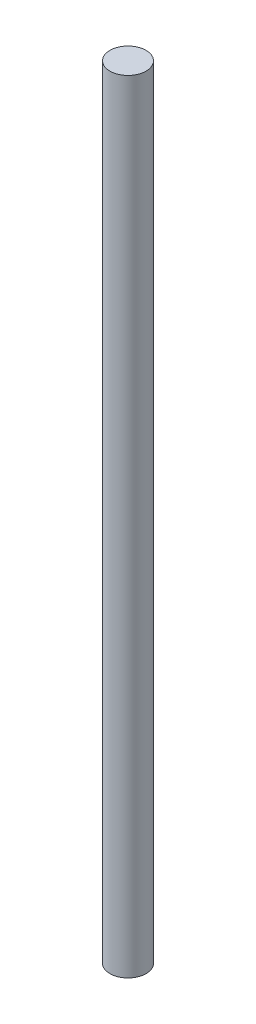
ISO-10303-21;
HEADER;
FILE_DESCRIPTION(('STEP AP214'),'2;1');
FILE_NAME('part.step','',(''),(''),'','','');
FILE_SCHEMA(('AUTOMOTIVE_DESIGN { 1 0 10303 214 1 1 1 1 }'));
ENDSEC;
DATA;
#1=APPLICATION_CONTEXT('core data for automotive mechanical design processes');
#2=APPLICATION_PROTOCOL_DEFINITION('international standard','automotive_design',2000,#1);
#3=PRODUCT_CONTEXT('',#1,'mechanical');
#4=PRODUCT('Part','Part','',(#3));
#5=PRODUCT_RELATED_PRODUCT_CATEGORY('part','',(#4));
#6=PRODUCT_DEFINITION_FORMATION('','',#4);
#7=PRODUCT_DEFINITION_CONTEXT('part definition',#1,'design');
#8=PRODUCT_DEFINITION('design','',#6,#7);
#9=PRODUCT_DEFINITION_SHAPE('','',#8);
#10=(LENGTH_UNIT() NAMED_UNIT(*) SI_UNIT(.MILLI.,.METRE.));
#11=(NAMED_UNIT(*) PLANE_ANGLE_UNIT() SI_UNIT($,.RADIAN.));
#12=(NAMED_UNIT(*) SI_UNIT($,.STERADIAN.) SOLID_ANGLE_UNIT());
#13=UNCERTAINTY_MEASURE_WITH_UNIT(LENGTH_MEASURE(1.E-05),#10,'distance_accuracy_value','');
#14=(GEOMETRIC_REPRESENTATION_CONTEXT(3) GLOBAL_UNCERTAINTY_ASSIGNED_CONTEXT((#13)) GLOBAL_UNIT_ASSIGNED_CONTEXT((#10,
#11,#12)) REPRESENTATION_CONTEXT('',''));
#15=CARTESIAN_POINT('',(0.,0.,0.));
#16=DIRECTION('',(0.,0.,1.));
#17=DIRECTION('',(1.,0.,0.));
#18=AXIS2_PLACEMENT_3D('',#15,#16,#17);
#19=CARTESIAN_POINT('',(0.,130.,0.));
#20=DIRECTION('',(0.,-1.,0.));
#21=DIRECTION('',(0.,0.,-1.));
#22=AXIS2_PLACEMENT_3D('',#19,#20,#21);
#23=CYLINDRICAL_SURFACE('',#22,3.);
#24=CARTESIAN_POINT('',(0.,130.,0.));
#25=DIRECTION('',(0.,1.,0.));
#26=DIRECTION('',(0.,0.,1.));
#27=AXIS2_PLACEMENT_3D('',#24,#25,#26);
#28=CIRCLE('',#27,3.);
#29=CARTESIAN_POINT('',(0.,130.,3.));
#30=VERTEX_POINT('',#29);
#31=EDGE_CURVE('E10',#30,#30,#28,.T.);
#32=ORIENTED_EDGE('',*,*,#31,.F.);
#33=EDGE_LOOP('',(#32));
#34=FACE_BOUND('',#33,.T.);
#35=CARTESIAN_POINT('',(0.,0.,0.));
#36=DIRECTION('',(0.,1.,0.));
#37=DIRECTION('',(0.,0.,1.));
#38=AXIS2_PLACEMENT_3D('',#35,#36,#37);
#39=CIRCLE('',#38,3.);
#40=CARTESIAN_POINT('',(0.,0.,3.));
#41=VERTEX_POINT('',#40);
#42=EDGE_CURVE('E32',#41,#41,#39,.T.);
#43=ORIENTED_EDGE('',*,*,#42,.T.);
#44=EDGE_LOOP('',(#43));
#45=FACE_BOUND('',#44,.T.);
#46=ADVANCED_FACE('F29',(#34,#45),#23,.T.);
#47=CARTESIAN_POINT('',(0.,130.,0.));
#48=DIRECTION('',(0.,1.,0.));
#49=DIRECTION('',(0.,0.,1.));
#50=AXIS2_PLACEMENT_3D('',#47,#48,#49);
#51=PLANE('',#50);
#52=ORIENTED_EDGE('',*,*,#31,.T.);
#53=EDGE_LOOP('',(#52));
#54=FACE_BOUND('',#53,.T.);
#55=ADVANCED_FACE('F44',(#54),#51,.T.);
#56=CARTESIAN_POINT('',(0.,0.,0.));
#57=DIRECTION('',(0.,1.,0.));
#58=DIRECTION('',(0.,0.,1.));
#59=AXIS2_PLACEMENT_3D('',#56,#57,#58);
#60=PLANE('',#59);
#61=ORIENTED_EDGE('',*,*,#42,.F.);
#62=EDGE_LOOP('',(#61));
#63=FACE_BOUND('',#62,.T.);
#64=ADVANCED_FACE('F42',(#63),#60,.F.);
#65=CLOSED_SHELL('',(#46,#55,#64));
#66=MANIFOLD_SOLID_BREP('B2',#65);
#67=ADVANCED_BREP_SHAPE_REPRESENTATION('',(#18,#66),#14);
#68=SHAPE_DEFINITION_REPRESENTATION(#9,#67);
ENDSEC;
END-ISO-10303-21;
